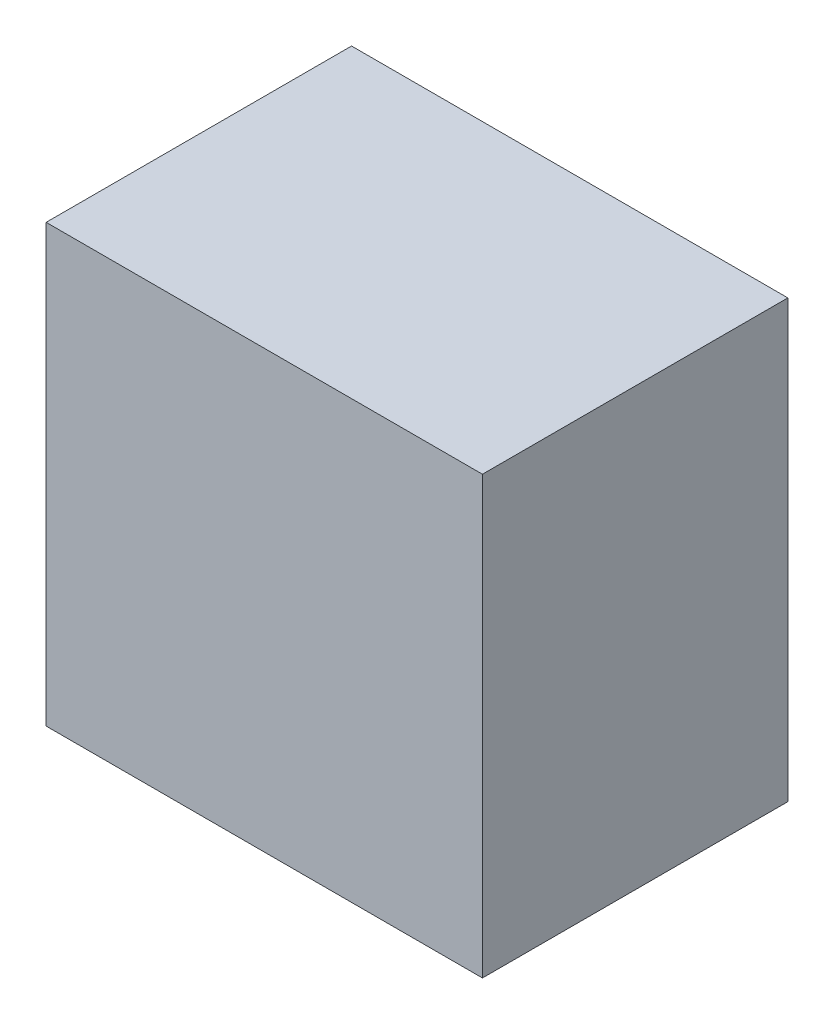
ISO-10303-21;
HEADER;
FILE_DESCRIPTION(('STEP AP214'),'2;1');
FILE_NAME('part.step','',(''),(''),'','','');
FILE_SCHEMA(('AUTOMOTIVE_DESIGN { 1 0 10303 214 1 1 1 1 }'));
ENDSEC;
DATA;
#1=APPLICATION_CONTEXT('core data for automotive mechanical design processes');
#2=APPLICATION_PROTOCOL_DEFINITION('international standard','automotive_design',2000,#1);
#3=PRODUCT_CONTEXT('',#1,'mechanical');
#4=PRODUCT('Part','Part','',(#3));
#5=PRODUCT_RELATED_PRODUCT_CATEGORY('part','',(#4));
#6=PRODUCT_DEFINITION_FORMATION('','',#4);
#7=PRODUCT_DEFINITION_CONTEXT('part definition',#1,'design');
#8=PRODUCT_DEFINITION('design','',#6,#7);
#9=PRODUCT_DEFINITION_SHAPE('','',#8);
#10=(LENGTH_UNIT() NAMED_UNIT(*) SI_UNIT(.MILLI.,.METRE.));
#11=(NAMED_UNIT(*) PLANE_ANGLE_UNIT() SI_UNIT($,.RADIAN.));
#12=(NAMED_UNIT(*) SI_UNIT($,.STERADIAN.) SOLID_ANGLE_UNIT());
#13=UNCERTAINTY_MEASURE_WITH_UNIT(LENGTH_MEASURE(1.E-05),#10,'distance_accuracy_value','');
#14=(GEOMETRIC_REPRESENTATION_CONTEXT(3) GLOBAL_UNCERTAINTY_ASSIGNED_CONTEXT((#13)) GLOBAL_UNIT_ASSIGNED_CONTEXT((#10,
#11,#12)) REPRESENTATION_CONTEXT('',''));
#15=CARTESIAN_POINT('',(0.,0.,0.));
#16=DIRECTION('',(0.,0.,1.));
#17=DIRECTION('',(1.,0.,0.));
#18=AXIS2_PLACEMENT_3D('',#15,#16,#17);
#19=CARTESIAN_POINT('',(-0.2499995,0.2499995,0.3499993));
#20=DIRECTION('',(0.,0.,-1.));
#21=DIRECTION('',(-1.,0.,0.));
#22=AXIS2_PLACEMENT_3D('',#19,#20,#21);
#23=PLANE('',#22);
#24=DIRECTION('',(1.,0.,0.));
#25=VECTOR('',#24,1.);
#26=CARTESIAN_POINT('',(-0.2499995,-0.2499995,0.3499993));
#27=LINE('',#26,#25);
#28=CARTESIAN_POINT('',(-0.2499995,-0.2499995,0.3499993));
#29=VERTEX_POINT('',#28);
#30=CARTESIAN_POINT('',(0.25000204,-0.2499995,0.3499993));
#31=VERTEX_POINT('',#30);
#32=EDGE_CURVE('E55',#29,#31,#27,.T.);
#33=ORIENTED_EDGE('',*,*,#32,.T.);
#34=DIRECTION('',(0.,1.,0.));
#35=VECTOR('',#34,1.);
#36=CARTESIAN_POINT('',(0.25000204,-0.2499995,0.3499993));
#37=LINE('',#36,#35);
#38=CARTESIAN_POINT('',(0.25000204,0.2499995,0.3499993));
#39=VERTEX_POINT('',#38);
#40=EDGE_CURVE('E57',#31,#39,#37,.T.);
#41=ORIENTED_EDGE('',*,*,#40,.T.);
#42=DIRECTION('',(1.,0.,0.));
#43=VECTOR('',#42,1.);
#44=CARTESIAN_POINT('',(0.25000204,0.2499995,0.3499993));
#45=LINE('',#44,#43);
#46=CARTESIAN_POINT('',(-0.2499995,0.2499995,0.3499993));
#47=VERTEX_POINT('',#46);
#48=EDGE_CURVE('E20',#39,#47,#45,.F.);
#49=ORIENTED_EDGE('',*,*,#48,.T.);
#50=DIRECTION('',(0.,1.,0.));
#51=VECTOR('',#50,1.);
#52=CARTESIAN_POINT('',(-0.2499995,0.2499995,0.3499993));
#53=LINE('',#52,#51);
#54=EDGE_CURVE('E80',#47,#29,#53,.F.);
#55=ORIENTED_EDGE('',*,*,#54,.T.);
#56=EDGE_LOOP('',(#33,#41,#49,#55));
#57=FACE_BOUND('',#56,.T.);
#58=ADVANCED_FACE('F17',(#57),#23,.F.);
#59=CARTESIAN_POINT('',(0.25000204,0.2499995,0.));
#60=DIRECTION('',(0.,-1.,0.));
#61=DIRECTION('',(0.,0.,-1.));
#62=AXIS2_PLACEMENT_3D('',#59,#60,#61);
#63=PLANE('',#62);
#64=DIRECTION('',(0.,0.,-1.));
#65=VECTOR('',#64,1.);
#66=CARTESIAN_POINT('',(-0.2499995,0.2499995,0.));
#67=LINE('',#66,#65);
#68=CARTESIAN_POINT('',(-0.2499995,0.2499995,0.));
#69=VERTEX_POINT('',#68);
#70=EDGE_CURVE('E68',#69,#47,#67,.F.);
#71=ORIENTED_EDGE('',*,*,#70,.T.);
#72=ORIENTED_EDGE('',*,*,#48,.F.);
#73=DIRECTION('',(0.,0.,1.));
#74=VECTOR('',#73,1.);
#75=CARTESIAN_POINT('',(0.25000204,0.2499995,0.));
#76=LINE('',#75,#74);
#77=CARTESIAN_POINT('',(0.25000204,0.2499995,0.));
#78=VERTEX_POINT('',#77);
#79=EDGE_CURVE('E63',#39,#78,#76,.F.);
#80=ORIENTED_EDGE('',*,*,#79,.T.);
#81=DIRECTION('',(-1.,0.,0.));
#82=VECTOR('',#81,1.);
#83=CARTESIAN_POINT('',(-0.2499995,0.2499995,0.));
#84=LINE('',#83,#82);
#85=EDGE_CURVE('E83',#69,#78,#84,.F.);
#86=ORIENTED_EDGE('',*,*,#85,.F.);
#87=EDGE_LOOP('',(#71,#72,#80,#86));
#88=FACE_BOUND('',#87,.T.);
#89=ADVANCED_FACE('F65',(#88),#63,.F.);
#90=CARTESIAN_POINT('',(0.25000204,-0.2499995,0.));
#91=DIRECTION('',(-1.,0.,0.));
#92=DIRECTION('',(0.,0.,1.));
#93=AXIS2_PLACEMENT_3D('',#90,#91,#92);
#94=PLANE('',#93);
#95=ORIENTED_EDGE('',*,*,#79,.F.);
#96=ORIENTED_EDGE('',*,*,#40,.F.);
#97=DIRECTION('',(0.,0.,1.));
#98=VECTOR('',#97,1.);
#99=CARTESIAN_POINT('',(0.25000204,-0.2499995,0.));
#100=LINE('',#99,#98);
#101=CARTESIAN_POINT('',(0.25000204,-0.2499995,0.));
#102=VERTEX_POINT('',#101);
#103=EDGE_CURVE('E75',#31,#102,#100,.F.);
#104=ORIENTED_EDGE('',*,*,#103,.T.);
#105=DIRECTION('',(0.,1.,0.));
#106=VECTOR('',#105,1.);
#107=CARTESIAN_POINT('',(0.25000204,0.2499995,0.));
#108=LINE('',#107,#106);
#109=EDGE_CURVE('E72',#78,#102,#108,.F.);
#110=ORIENTED_EDGE('',*,*,#109,.F.);
#111=EDGE_LOOP('',(#95,#96,#104,#110));
#112=FACE_BOUND('',#111,.T.);
#113=ADVANCED_FACE('F70',(#112),#94,.F.);
#114=CARTESIAN_POINT('',(-0.2499995,-0.2499995,0.));
#115=DIRECTION('',(0.,1.,0.));
#116=DIRECTION('',(0.,0.,1.));
#117=AXIS2_PLACEMENT_3D('',#114,#115,#116);
#118=PLANE('',#117);
#119=ORIENTED_EDGE('',*,*,#103,.F.);
#120=ORIENTED_EDGE('',*,*,#32,.F.);
#121=DIRECTION('',(0.,0.,-1.));
#122=VECTOR('',#121,1.);
#123=CARTESIAN_POINT('',(-0.2499995,-0.2499995,0.));
#124=LINE('',#123,#122);
#125=CARTESIAN_POINT('',(-0.2499995,-0.2499995,0.));
#126=VERTEX_POINT('',#125);
#127=EDGE_CURVE('E35',#29,#126,#124,.T.);
#128=ORIENTED_EDGE('',*,*,#127,.T.);
#129=DIRECTION('',(-1.,0.,0.));
#130=VECTOR('',#129,1.);
#131=CARTESIAN_POINT('',(-0.2499995,-0.2499995,0.));
#132=LINE('',#131,#130);
#133=EDGE_CURVE('E26',#102,#126,#132,.T.);
#134=ORIENTED_EDGE('',*,*,#133,.F.);
#135=EDGE_LOOP('',(#119,#120,#128,#134));
#136=FACE_BOUND('',#135,.T.);
#137=ADVANCED_FACE('F89',(#136),#118,.F.);
#138=CARTESIAN_POINT('',(-0.2499995,0.2499995,0.));
#139=DIRECTION('',(1.,0.,0.));
#140=DIRECTION('',(0.,0.,-1.));
#141=AXIS2_PLACEMENT_3D('',#138,#139,#140);
#142=PLANE('',#141);
#143=ORIENTED_EDGE('',*,*,#127,.F.);
#144=ORIENTED_EDGE('',*,*,#54,.F.);
#145=ORIENTED_EDGE('',*,*,#70,.F.);
#146=DIRECTION('',(0.,1.,0.));
#147=VECTOR('',#146,1.);
#148=CARTESIAN_POINT('',(-0.2499995,0.2499995,0.));
#149=LINE('',#148,#147);
#150=EDGE_CURVE('E11',#126,#69,#149,.T.);
#151=ORIENTED_EDGE('',*,*,#150,.F.);
#152=EDGE_LOOP('',(#143,#144,#145,#151));
#153=FACE_BOUND('',#152,.T.);
#154=ADVANCED_FACE('F91',(#153),#142,.F.);
#155=CARTESIAN_POINT('',(-0.2499995,0.2499995,0.));
#156=DIRECTION('',(0.,0.,-1.));
#157=DIRECTION('',(-1.,0.,0.));
#158=AXIS2_PLACEMENT_3D('',#155,#156,#157);
#159=PLANE('',#158);
#160=ORIENTED_EDGE('',*,*,#133,.T.);
#161=ORIENTED_EDGE('',*,*,#150,.T.);
#162=ORIENTED_EDGE('',*,*,#85,.T.);
#163=ORIENTED_EDGE('',*,*,#109,.T.);
#164=EDGE_LOOP('',(#160,#161,#162,#163));
#165=FACE_BOUND('',#164,.T.);
#166=ADVANCED_FACE('F88',(#165),#159,.T.);
#167=CLOSED_SHELL('',(#58,#89,#113,#137,#154,#166));
#168=MANIFOLD_SOLID_BREP('B1',#167);
#169=ADVANCED_BREP_SHAPE_REPRESENTATION('',(#18,#168),#14);
#170=SHAPE_DEFINITION_REPRESENTATION(#9,#169);
ENDSEC;
END-ISO-10303-21;
